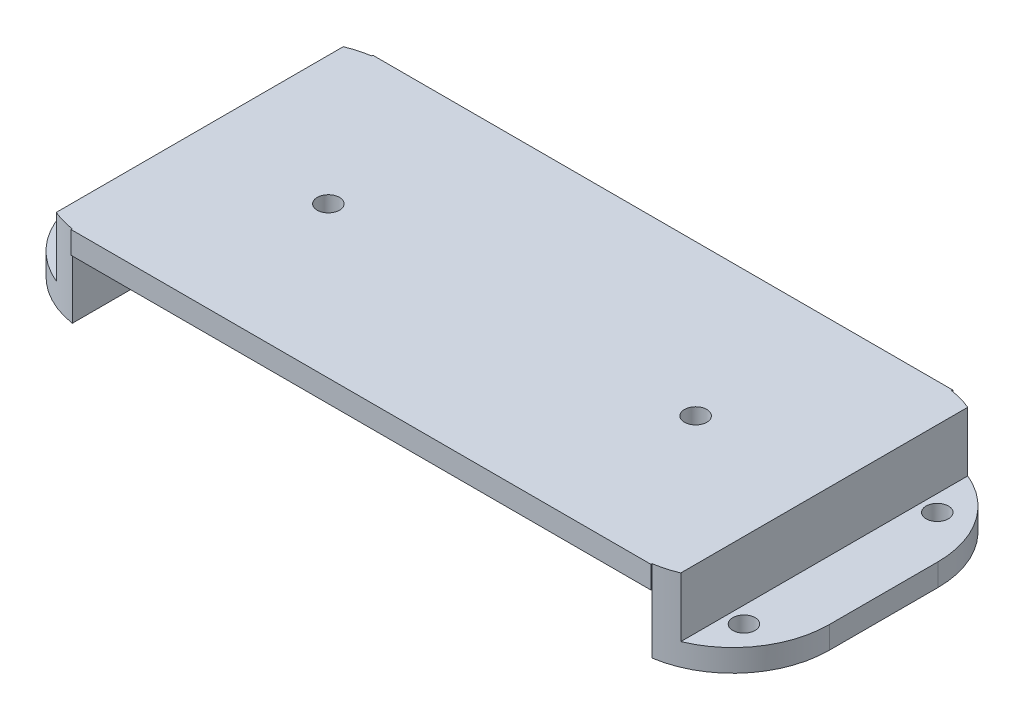
ISO-10303-21;
HEADER;
FILE_DESCRIPTION(('STEP AP214'),'2;1');
FILE_NAME('part.step','',(''),(''),'','','');
FILE_SCHEMA(('AUTOMOTIVE_DESIGN { 1 0 10303 214 1 1 1 1 }'));
ENDSEC;
DATA;
#1=APPLICATION_CONTEXT('core data for automotive mechanical design processes');
#2=APPLICATION_PROTOCOL_DEFINITION('international standard','automotive_design',2000,#1);
#3=PRODUCT_CONTEXT('',#1,'mechanical');
#4=PRODUCT('Part','Part','',(#3));
#5=PRODUCT_RELATED_PRODUCT_CATEGORY('part','',(#4));
#6=PRODUCT_DEFINITION_FORMATION('','',#4);
#7=PRODUCT_DEFINITION_CONTEXT('part definition',#1,'design');
#8=PRODUCT_DEFINITION('design','',#6,#7);
#9=PRODUCT_DEFINITION_SHAPE('','',#8);
#10=(LENGTH_UNIT() NAMED_UNIT(*) SI_UNIT(.MILLI.,.METRE.));
#11=(NAMED_UNIT(*) PLANE_ANGLE_UNIT() SI_UNIT($,.RADIAN.));
#12=(NAMED_UNIT(*) SI_UNIT($,.STERADIAN.) SOLID_ANGLE_UNIT());
#13=UNCERTAINTY_MEASURE_WITH_UNIT(LENGTH_MEASURE(1.E-05),#10,'distance_accuracy_value','');
#14=(GEOMETRIC_REPRESENTATION_CONTEXT(3) GLOBAL_UNCERTAINTY_ASSIGNED_CONTEXT((#13)) GLOBAL_UNIT_ASSIGNED_CONTEXT((#10,
#11,#12)) REPRESENTATION_CONTEXT('',''));
#15=CARTESIAN_POINT('',(0.,0.,0.));
#16=DIRECTION('',(0.,0.,1.));
#17=DIRECTION('',(1.,0.,0.));
#18=AXIS2_PLACEMENT_3D('',#15,#16,#17);
#19=CARTESIAN_POINT('',(0.,-3.6,40.6));
#20=DIRECTION('',(0.,1.,0.));
#21=DIRECTION('',(0.,0.,1.));
#22=AXIS2_PLACEMENT_3D('',#19,#20,#21);
#23=PLANE('',#22);
#24=CARTESIAN_POINT('',(74.8251969934209,-3.6,20.3));
#25=DIRECTION('',(0.,1.,0.));
#26=DIRECTION('',(0.,0.,1.));
#27=AXIS2_PLACEMENT_3D('',#24,#25,#26);
#28=CIRCLE('',#27,1.50000000000001);
#29=CARTESIAN_POINT('',(74.8251969934209,-3.6,21.8));
#30=VERTEX_POINT('',#29);
#31=EDGE_CURVE('E415',#30,#30,#28,.F.);
#32=ORIENTED_EDGE('',*,*,#31,.T.);
#33=EDGE_LOOP('',(#32));
#34=FACE_BOUND('',#33,.T.);
#35=DIRECTION('',(0.,0.,-1.));
#36=VECTOR('',#35,1.);
#37=CARTESIAN_POINT('',(11.1251969934209,-3.6,40.6));
#38=LINE('',#37,#36);
#39=CARTESIAN_POINT('',(11.1251969934209,-3.6,40.6));
#40=VERTEX_POINT('',#39);
#41=CARTESIAN_POINT('',(11.1251969934209,-3.6,40.4452325786651));
#42=VERTEX_POINT('',#41);
#43=EDGE_CURVE('E497',#40,#42,#38,.T.);
#44=ORIENTED_EDGE('',*,*,#43,.F.);
#45=DIRECTION('',(1.,0.,0.));
#46=VECTOR('',#45,1.);
#47=CARTESIAN_POINT('',(0.,-3.6,40.6));
#48=LINE('',#47,#46);
#49=CARTESIAN_POINT('',(89.1251969934209,-3.6,40.6));
#50=VERTEX_POINT('',#49);
#51=EDGE_CURVE('E328',#40,#50,#48,.T.);
#52=ORIENTED_EDGE('',*,*,#51,.T.);
#53=DIRECTION('',(0.,0.,1.));
#54=VECTOR('',#53,1.);
#55=CARTESIAN_POINT('',(89.1251969934209,-3.6,40.6));
#56=LINE('',#55,#54);
#57=CARTESIAN_POINT('',(89.1251969934209,-3.6,40.4452325786651));
#58=VERTEX_POINT('',#57);
#59=EDGE_CURVE('E388',#58,#50,#56,.T.);
#60=ORIENTED_EDGE('',*,*,#59,.F.);
#61=CARTESIAN_POINT('',(87.1251969934209,-3.6,27.6));
#62=DIRECTION('',(0.,1.,0.));
#63=DIRECTION('',(0.,0.,1.));
#64=AXIS2_PLACEMENT_3D('',#61,#62,#63);
#65=CIRCLE('',#64,13.);
#66=CARTESIAN_POINT('',(92.1251969934209,-3.6,39.6));
#67=VERTEX_POINT('',#66);
#68=EDGE_CURVE('E478',#58,#67,#65,.T.);
#69=ORIENTED_EDGE('',*,*,#68,.T.);
#70=DIRECTION('',(0.,0.,-1.));
#71=VECTOR('',#70,1.);
#72=CARTESIAN_POINT('',(92.1251969934209,-3.6,40.6));
#73=LINE('',#72,#71);
#74=CARTESIAN_POINT('',(92.1251969934209,-3.6,0.999999999999996));
#75=VERTEX_POINT('',#74);
#76=EDGE_CURVE('E339',#67,#75,#73,.T.);
#77=ORIENTED_EDGE('',*,*,#76,.T.);
#78=CARTESIAN_POINT('',(87.1251969934209,-3.6,13.));
#79=DIRECTION('',(0.,1.,0.));
#80=DIRECTION('',(0.,0.,1.));
#81=AXIS2_PLACEMENT_3D('',#78,#79,#80);
#82=CIRCLE('',#81,13.);
#83=CARTESIAN_POINT('',(89.1251969934209,-3.6,0.15476742133487));
#84=VERTEX_POINT('',#83);
#85=EDGE_CURVE('E389',#75,#84,#82,.T.);
#86=ORIENTED_EDGE('',*,*,#85,.T.);
#87=DIRECTION('',(0.,0.,1.));
#88=VECTOR('',#87,1.);
#89=CARTESIAN_POINT('',(89.1251969934209,-3.6,40.6));
#90=LINE('',#89,#88);
#91=CARTESIAN_POINT('',(89.1251969934209,-3.6,0.));
#92=VERTEX_POINT('',#91);
#93=EDGE_CURVE('E490',#92,#84,#90,.T.);
#94=ORIENTED_EDGE('',*,*,#93,.F.);
#95=DIRECTION('',(1.,0.,0.));
#96=VECTOR('',#95,1.);
#97=CARTESIAN_POINT('',(0.,-3.6,0.));
#98=LINE('',#97,#96);
#99=CARTESIAN_POINT('',(11.1251969934209,-3.6,0.));
#100=VERTEX_POINT('',#99);
#101=EDGE_CURVE('E524',#100,#92,#98,.T.);
#102=ORIENTED_EDGE('',*,*,#101,.F.);
#103=DIRECTION('',(0.,0.,-1.));
#104=VECTOR('',#103,1.);
#105=CARTESIAN_POINT('',(11.1251969934209,-3.6,40.6));
#106=LINE('',#105,#104);
#107=CARTESIAN_POINT('',(11.1251969934209,-3.6,0.154767421334882));
#108=VERTEX_POINT('',#107);
#109=EDGE_CURVE('E182',#108,#100,#106,.T.);
#110=ORIENTED_EDGE('',*,*,#109,.F.);
#111=CARTESIAN_POINT('',(13.1251969934209,-3.6,13.));
#112=DIRECTION('',(0.,1.,0.));
#113=DIRECTION('',(0.,0.,1.));
#114=AXIS2_PLACEMENT_3D('',#111,#112,#113);
#115=CIRCLE('',#114,13.);
#116=CARTESIAN_POINT('',(8.12519699342092,-3.6,1.));
#117=VERTEX_POINT('',#116);
#118=EDGE_CURVE('E174',#117,#108,#115,.F.);
#119=ORIENTED_EDGE('',*,*,#118,.F.);
#120=DIRECTION('',(0.,0.,-1.));
#121=VECTOR('',#120,1.);
#122=CARTESIAN_POINT('',(8.12519699342092,-3.6,40.6));
#123=LINE('',#122,#121);
#124=CARTESIAN_POINT('',(8.12519699342092,-3.6,39.6));
#125=VERTEX_POINT('',#124);
#126=EDGE_CURVE('E335',#125,#117,#123,.T.);
#127=ORIENTED_EDGE('',*,*,#126,.F.);
#128=CARTESIAN_POINT('',(13.1251969934209,-3.6,27.6));
#129=DIRECTION('',(0.,1.,0.));
#130=DIRECTION('',(0.,0.,1.));
#131=AXIS2_PLACEMENT_3D('',#128,#129,#130);
#132=CIRCLE('',#131,13.);
#133=EDGE_CURVE('E12',#42,#125,#132,.F.);
#134=ORIENTED_EDGE('',*,*,#133,.F.);
#135=EDGE_LOOP('',(#44,#52,#60,#69,#77,#86,#94,#102,#110,#119,#127,#134));
#136=FACE_BOUND('',#135,.T.);
#137=CARTESIAN_POINT('',(25.4251969934209,-3.6,20.3));
#138=DIRECTION('',(0.,1.,0.));
#139=DIRECTION('',(0.,0.,1.));
#140=AXIS2_PLACEMENT_3D('',#137,#138,#139);
#141=CIRCLE('',#140,1.5);
#142=CARTESIAN_POINT('',(25.4251969934209,-3.6,21.8));
#143=VERTEX_POINT('',#142);
#144=EDGE_CURVE('E407',#143,#143,#141,.T.);
#145=ORIENTED_EDGE('',*,*,#144,.F.);
#146=EDGE_LOOP('',(#145));
#147=FACE_BOUND('',#146,.T.);
#148=ADVANCED_FACE('F164',(#34,#136,#147),#23,.T.);
#149=CARTESIAN_POINT('',(0.,-6.6,40.6));
#150=DIRECTION('',(0.,1.,0.));
#151=DIRECTION('',(0.,0.,1.));
#152=AXIS2_PLACEMENT_3D('',#149,#150,#151);
#153=PLANE('',#152);
#154=DIRECTION('',(1.,0.,0.));
#155=VECTOR('',#154,1.);
#156=CARTESIAN_POINT('',(0.,-6.6,0.));
#157=LINE('',#156,#155);
#158=CARTESIAN_POINT('',(11.1251969934209,-6.6,0.));
#159=VERTEX_POINT('',#158);
#160=CARTESIAN_POINT('',(89.1251969934209,-6.6,0.));
#161=VERTEX_POINT('',#160);
#162=EDGE_CURVE('E365',#159,#161,#157,.T.);
#163=ORIENTED_EDGE('',*,*,#162,.T.);
#164=DIRECTION('',(0.,0.,1.));
#165=VECTOR('',#164,1.);
#166=CARTESIAN_POINT('',(89.1251969934209,-6.6,40.6));
#167=LINE('',#166,#165);
#168=CARTESIAN_POINT('',(89.1251969934209,-6.6,0.15476742133487));
#169=VERTEX_POINT('',#168);
#170=EDGE_CURVE('E493',#161,#169,#167,.T.);
#171=ORIENTED_EDGE('',*,*,#170,.T.);
#172=DIRECTION('',(0.,0.,-1.));
#173=VECTOR('',#172,1.);
#174=CARTESIAN_POINT('',(89.1251969934209,-6.6,40.6));
#175=LINE('',#174,#173);
#176=CARTESIAN_POINT('',(89.1251969934209,-6.6,40.4452325786651));
#177=VERTEX_POINT('',#176);
#178=EDGE_CURVE('E347',#177,#169,#175,.T.);
#179=ORIENTED_EDGE('',*,*,#178,.F.);
#180=CARTESIAN_POINT('',(89.1251969934209,-6.6,40.6));
#181=VERTEX_POINT('',#180);
#182=EDGE_CURVE('E348',#181,#177,#175,.T.);
#183=ORIENTED_EDGE('',*,*,#182,.F.);
#184=DIRECTION('',(1.,0.,0.));
#185=VECTOR('',#184,1.);
#186=CARTESIAN_POINT('',(0.,-6.6,40.6));
#187=LINE('',#186,#185);
#188=CARTESIAN_POINT('',(11.1251969934209,-6.6,40.6));
#189=VERTEX_POINT('',#188);
#190=EDGE_CURVE('E520',#189,#181,#187,.T.);
#191=ORIENTED_EDGE('',*,*,#190,.F.);
#192=DIRECTION('',(0.,0.,-1.));
#193=VECTOR('',#192,1.);
#194=CARTESIAN_POINT('',(11.1251969934209,-6.6,40.6));
#195=LINE('',#194,#193);
#196=CARTESIAN_POINT('',(11.1251969934209,-6.6,40.4452325786651));
#197=VERTEX_POINT('',#196);
#198=EDGE_CURVE('E352',#189,#197,#195,.T.);
#199=ORIENTED_EDGE('',*,*,#198,.T.);
#200=CARTESIAN_POINT('',(11.1251969934209,-6.6,0.154767421334882));
#201=VERTEX_POINT('',#200);
#202=EDGE_CURVE('E351',#197,#201,#195,.T.);
#203=ORIENTED_EDGE('',*,*,#202,.T.);
#204=DIRECTION('',(0.,0.,-1.));
#205=VECTOR('',#204,1.);
#206=CARTESIAN_POINT('',(11.1251969934209,-6.6,40.6));
#207=LINE('',#206,#205);
#208=EDGE_CURVE('E502',#201,#159,#207,.T.);
#209=ORIENTED_EDGE('',*,*,#208,.T.);
#210=EDGE_LOOP('',(#163,#171,#179,#183,#191,#199,#203,#209));
#211=FACE_BOUND('',#210,.T.);
#212=CARTESIAN_POINT('',(74.8251969934209,-6.6,20.3));
#213=DIRECTION('',(0.,1.,0.));
#214=DIRECTION('',(0.,0.,1.));
#215=AXIS2_PLACEMENT_3D('',#212,#213,#214);
#216=CIRCLE('',#215,1.50000000000001);
#217=CARTESIAN_POINT('',(74.8251969934209,-6.6,21.8));
#218=VERTEX_POINT('',#217);
#219=EDGE_CURVE('E404',#218,#218,#216,.F.);
#220=ORIENTED_EDGE('',*,*,#219,.F.);
#221=EDGE_LOOP('',(#220));
#222=FACE_BOUND('',#221,.T.);
#223=CARTESIAN_POINT('',(25.4251969934209,-6.6,20.3));
#224=DIRECTION('',(0.,1.,0.));
#225=DIRECTION('',(0.,0.,1.));
#226=AXIS2_PLACEMENT_3D('',#223,#224,#225);
#227=CIRCLE('',#226,1.5);
#228=CARTESIAN_POINT('',(25.4251969934209,-6.6,21.8));
#229=VERTEX_POINT('',#228);
#230=EDGE_CURVE('E168',#229,#229,#227,.T.);
#231=ORIENTED_EDGE('',*,*,#230,.T.);
#232=EDGE_LOOP('',(#231));
#233=FACE_BOUND('',#232,.T.);
#234=ADVANCED_FACE('F557',(#211,#222,#233),#153,.F.);
#235=CARTESIAN_POINT('',(0.,-14.6,40.6));
#236=DIRECTION('',(0.,1.,0.));
#237=DIRECTION('',(0.,0.,1.));
#238=AXIS2_PLACEMENT_3D('',#235,#236,#237);
#239=PLANE('',#238);
#240=CARTESIAN_POINT('',(5.92519699342091,-14.6,7.30000000000001));
#241=DIRECTION('',(0.,-1.,0.));
#242=DIRECTION('',(0.,0.,-1.));
#243=AXIS2_PLACEMENT_3D('',#240,#241,#242);
#244=CIRCLE('',#243,1.5);
#245=CARTESIAN_POINT('',(5.92519699342091,-14.6,5.80000000000002));
#246=VERTEX_POINT('',#245);
#247=EDGE_CURVE('E413',#246,#246,#244,.F.);
#248=ORIENTED_EDGE('',*,*,#247,.T.);
#249=EDGE_LOOP('',(#248));
#250=FACE_BOUND('',#249,.T.);
#251=CARTESIAN_POINT('',(5.92519699342092,-14.6,33.3));
#252=DIRECTION('',(0.,-1.,0.));
#253=DIRECTION('',(0.,0.,-1.));
#254=AXIS2_PLACEMENT_3D('',#251,#252,#253);
#255=CIRCLE('',#254,1.5);
#256=CARTESIAN_POINT('',(5.92519699342092,-14.6,31.8));
#257=VERTEX_POINT('',#256);
#258=EDGE_CURVE('E316',#257,#257,#255,.F.);
#259=ORIENTED_EDGE('',*,*,#258,.T.);
#260=EDGE_LOOP('',(#259));
#261=FACE_BOUND('',#260,.T.);
#262=DIRECTION('',(0.,0.,-1.));
#263=VECTOR('',#262,1.);
#264=CARTESIAN_POINT('',(11.1251969934209,-14.6,40.6));
#265=LINE('',#264,#263);
#266=CARTESIAN_POINT('',(11.1251969934209,-14.6,40.4452325786651));
#267=VERTEX_POINT('',#266);
#268=CARTESIAN_POINT('',(11.1251969934209,-14.6,0.154767421334882));
#269=VERTEX_POINT('',#268);
#270=EDGE_CURVE('E322',#267,#269,#265,.T.);
#271=ORIENTED_EDGE('',*,*,#270,.F.);
#272=CARTESIAN_POINT('',(13.1251969934209,-14.6,27.6));
#273=DIRECTION('',(0.,-1.,0.));
#274=DIRECTION('',(0.,0.,-1.));
#275=AXIS2_PLACEMENT_3D('',#272,#273,#274);
#276=CIRCLE('',#275,13.);
#277=CARTESIAN_POINT('',(0.125196993420919,-14.6,27.5999999999999));
#278=VERTEX_POINT('',#277);
#279=EDGE_CURVE('E320',#278,#267,#276,.F.);
#280=ORIENTED_EDGE('',*,*,#279,.F.);
#281=DIRECTION('',(0.,0.,-1.));
#282=VECTOR('',#281,1.);
#283=CARTESIAN_POINT('',(0.125196993420919,-14.6,40.6));
#284=LINE('',#283,#282);
#285=CARTESIAN_POINT('',(0.125196993420919,-14.6,13.0000000000001));
#286=VERTEX_POINT('',#285);
#287=EDGE_CURVE('E312',#278,#286,#284,.T.);
#288=ORIENTED_EDGE('',*,*,#287,.T.);
#289=CARTESIAN_POINT('',(13.1251969934209,-14.6,13.));
#290=DIRECTION('',(0.,-1.,0.));
#291=DIRECTION('',(0.,0.,-1.));
#292=AXIS2_PLACEMENT_3D('',#289,#290,#291);
#293=CIRCLE('',#292,13.);
#294=EDGE_CURVE('E291',#269,#286,#293,.F.);
#295=ORIENTED_EDGE('',*,*,#294,.F.);
#296=EDGE_LOOP('',(#271,#280,#288,#295));
#297=FACE_BOUND('',#296,.T.);
#298=ADVANCED_FACE('F319',(#250,#261,#297),#239,.F.);
#299=CARTESIAN_POINT('',(0.125196993420918,0.,40.6));
#300=DIRECTION('',(1.,0.,0.));
#301=DIRECTION('',(0.,1.,0.));
#302=AXIS2_PLACEMENT_3D('',#299,#300,#301);
#303=PLANE('',#302);
#304=ORIENTED_EDGE('',*,*,#287,.F.);
#305=DIRECTION('',(0.,-1.,0.));
#306=VECTOR('',#305,1.);
#307=CARTESIAN_POINT('',(0.125196993420919,9.4,27.5999999999999));
#308=LINE('',#307,#306);
#309=CARTESIAN_POINT('',(0.125196993420919,-11.6,27.5999999999999));
#310=VERTEX_POINT('',#309);
#311=EDGE_CURVE('E436',#310,#278,#308,.T.);
#312=ORIENTED_EDGE('',*,*,#311,.F.);
#313=DIRECTION('',(0.,0.,-1.));
#314=VECTOR('',#313,1.);
#315=CARTESIAN_POINT('',(0.125196993420919,-11.6,40.6));
#316=LINE('',#315,#314);
#317=CARTESIAN_POINT('',(0.125196993420919,-11.6,13.0000000000001));
#318=VERTEX_POINT('',#317);
#319=EDGE_CURVE('E314',#310,#318,#316,.T.);
#320=ORIENTED_EDGE('',*,*,#319,.T.);
#321=DIRECTION('',(0.,-1.,0.));
#322=VECTOR('',#321,1.);
#323=CARTESIAN_POINT('',(0.125196993420919,9.4,13.0000000000001));
#324=LINE('',#323,#322);
#325=EDGE_CURVE('E294',#318,#286,#324,.T.);
#326=ORIENTED_EDGE('',*,*,#325,.T.);
#327=EDGE_LOOP('',(#304,#312,#320,#326));
#328=FACE_BOUND('',#327,.T.);
#329=ADVANCED_FACE('F310',(#328),#303,.F.);
#330=CARTESIAN_POINT('',(0.,-11.6,40.6));
#331=DIRECTION('',(0.,-1.,0.));
#332=DIRECTION('',(1.,0.,0.));
#333=AXIS2_PLACEMENT_3D('',#330,#331,#332);
#334=PLANE('',#333);
#335=CARTESIAN_POINT('',(5.92519699342091,-11.6,7.30000000000001));
#336=DIRECTION('',(0.,-1.,0.));
#337=DIRECTION('',(1.,0.,0.));
#338=AXIS2_PLACEMENT_3D('',#335,#336,#337);
#339=CIRCLE('',#338,1.5);
#340=CARTESIAN_POINT('',(7.42519699342091,-11.6,7.30000000000001));
#341=VERTEX_POINT('',#340);
#342=EDGE_CURVE('E370',#341,#341,#339,.F.);
#343=ORIENTED_EDGE('',*,*,#342,.F.);
#344=EDGE_LOOP('',(#343));
#345=FACE_BOUND('',#344,.T.);
#346=CARTESIAN_POINT('',(5.92519699342092,-11.6,33.3));
#347=DIRECTION('',(0.,-1.,0.));
#348=DIRECTION('',(1.,0.,0.));
#349=AXIS2_PLACEMENT_3D('',#346,#347,#348);
#350=CIRCLE('',#349,1.5);
#351=CARTESIAN_POINT('',(7.42519699342092,-11.6,33.3));
#352=VERTEX_POINT('',#351);
#353=EDGE_CURVE('E397',#352,#352,#350,.F.);
#354=ORIENTED_EDGE('',*,*,#353,.F.);
#355=EDGE_LOOP('',(#354));
#356=FACE_BOUND('',#355,.T.);
#357=ORIENTED_EDGE('',*,*,#319,.F.);
#358=CARTESIAN_POINT('',(13.1251969934209,-11.6,27.6));
#359=DIRECTION('',(0.,-1.,0.));
#360=DIRECTION('',(1.,0.,0.));
#361=AXIS2_PLACEMENT_3D('',#358,#359,#360);
#362=CIRCLE('',#361,13.);
#363=CARTESIAN_POINT('',(8.12519699342091,-11.6,39.6));
#364=VERTEX_POINT('',#363);
#365=EDGE_CURVE('E401',#310,#364,#362,.F.);
#366=ORIENTED_EDGE('',*,*,#365,.T.);
#367=DIRECTION('',(0.,0.,-1.));
#368=VECTOR('',#367,1.);
#369=CARTESIAN_POINT('',(8.12519699342092,-11.6,40.6));
#370=LINE('',#369,#368);
#371=CARTESIAN_POINT('',(8.12519699342091,-11.6,1.00000000000001));
#372=VERTEX_POINT('',#371);
#373=EDGE_CURVE('E326',#364,#372,#370,.T.);
#374=ORIENTED_EDGE('',*,*,#373,.T.);
#375=CARTESIAN_POINT('',(13.1251969934209,-11.6,13.));
#376=DIRECTION('',(0.,-1.,0.));
#377=DIRECTION('',(1.,0.,0.));
#378=AXIS2_PLACEMENT_3D('',#375,#376,#377);
#379=CIRCLE('',#378,13.);
#380=EDGE_CURVE('E510',#372,#318,#379,.F.);
#381=ORIENTED_EDGE('',*,*,#380,.T.);
#382=EDGE_LOOP('',(#357,#366,#374,#381));
#383=FACE_BOUND('',#382,.T.);
#384=ADVANCED_FACE('F613',(#345,#356,#383),#334,.F.);
#385=CARTESIAN_POINT('',(89.1251969934209,0.,40.6));
#386=DIRECTION('',(1.,0.,0.));
#387=DIRECTION('',(0.,0.,-1.));
#388=AXIS2_PLACEMENT_3D('',#385,#386,#387);
#389=PLANE('',#388);
#390=DIRECTION('',(0.,-1.,0.));
#391=VECTOR('',#390,1.);
#392=CARTESIAN_POINT('',(89.1251969934209,9.4,0.15476742133487));
#393=LINE('',#392,#391);
#394=CARTESIAN_POINT('',(89.1251969934209,-14.6,0.15476742133487));
#395=VERTEX_POINT('',#394);
#396=EDGE_CURVE('E459',#169,#395,#393,.T.);
#397=ORIENTED_EDGE('',*,*,#396,.T.);
#398=DIRECTION('',(0.,0.,-1.));
#399=VECTOR('',#398,1.);
#400=CARTESIAN_POINT('',(89.1251969934209,-14.6,40.6));
#401=LINE('',#400,#399);
#402=CARTESIAN_POINT('',(89.1251969934209,-14.6,40.4452325786651));
#403=VERTEX_POINT('',#402);
#404=EDGE_CURVE('E343',#403,#395,#401,.T.);
#405=ORIENTED_EDGE('',*,*,#404,.F.);
#406=DIRECTION('',(0.,-1.,0.));
#407=VECTOR('',#406,1.);
#408=CARTESIAN_POINT('',(89.1251969934209,9.4,40.4452325786651));
#409=LINE('',#408,#407);
#410=EDGE_CURVE('E452',#177,#403,#409,.T.);
#411=ORIENTED_EDGE('',*,*,#410,.F.);
#412=ORIENTED_EDGE('',*,*,#178,.T.);
#413=EDGE_LOOP('',(#397,#405,#411,#412));
#414=FACE_BOUND('',#413,.T.);
#415=ADVANCED_FACE('F566',(#414),#389,.F.);
#416=CARTESIAN_POINT('',(92.1251969934209,0.,40.6));
#417=DIRECTION('',(-1.,0.,0.));
#418=DIRECTION('',(0.,0.,1.));
#419=AXIS2_PLACEMENT_3D('',#416,#417,#418);
#420=PLANE('',#419);
#421=DIRECTION('',(0.,-1.,0.));
#422=VECTOR('',#421,1.);
#423=CARTESIAN_POINT('',(92.1251969934209,9.4,0.999999999999996));
#424=LINE('',#423,#422);
#425=CARTESIAN_POINT('',(92.1251969934209,-11.6,0.999999999999996));
#426=VERTEX_POINT('',#425);
#427=EDGE_CURVE('E482',#75,#426,#424,.T.);
#428=ORIENTED_EDGE('',*,*,#427,.F.);
#429=ORIENTED_EDGE('',*,*,#76,.F.);
#430=DIRECTION('',(0.,-1.,0.));
#431=VECTOR('',#430,1.);
#432=CARTESIAN_POINT('',(92.1251969934209,9.4,39.6));
#433=LINE('',#432,#431);
#434=CARTESIAN_POINT('',(92.1251969934209,-11.6,39.6));
#435=VERTEX_POINT('',#434);
#436=EDGE_CURVE('E375',#435,#67,#433,.F.);
#437=ORIENTED_EDGE('',*,*,#436,.F.);
#438=DIRECTION('',(0.,0.,-1.));
#439=VECTOR('',#438,1.);
#440=CARTESIAN_POINT('',(92.1251969934209,-11.6,40.6));
#441=LINE('',#440,#439);
#442=EDGE_CURVE('E356',#435,#426,#441,.T.);
#443=ORIENTED_EDGE('',*,*,#442,.T.);
#444=EDGE_LOOP('',(#428,#429,#437,#443));
#445=FACE_BOUND('',#444,.T.);
#446=ADVANCED_FACE('F580',(#445),#420,.F.);
#447=CARTESIAN_POINT('',(0.,-14.6,40.6));
#448=DIRECTION('',(0.,-1.,0.));
#449=DIRECTION('',(0.,0.,-1.));
#450=AXIS2_PLACEMENT_3D('',#447,#448,#449);
#451=PLANE('',#450);
#452=CARTESIAN_POINT('',(94.3251969934209,-14.6,7.3));
#453=DIRECTION('',(0.,-1.,0.));
#454=DIRECTION('',(0.,0.,-1.));
#455=AXIS2_PLACEMENT_3D('',#452,#453,#454);
#456=CIRCLE('',#455,1.5);
#457=CARTESIAN_POINT('',(94.3251969934209,-14.6,5.8));
#458=VERTEX_POINT('',#457);
#459=EDGE_CURVE('E431',#458,#458,#456,.T.);
#460=ORIENTED_EDGE('',*,*,#459,.F.);
#461=EDGE_LOOP('',(#460));
#462=FACE_BOUND('',#461,.T.);
#463=CARTESIAN_POINT('',(94.3251969934209,-14.6,33.3));
#464=DIRECTION('',(0.,-1.,0.));
#465=DIRECTION('',(0.,0.,-1.));
#466=AXIS2_PLACEMENT_3D('',#463,#464,#465);
#467=CIRCLE('',#466,1.5);
#468=CARTESIAN_POINT('',(94.3251969934209,-14.6,31.8));
#469=VERTEX_POINT('',#468);
#470=EDGE_CURVE('E376',#469,#469,#467,.T.);
#471=ORIENTED_EDGE('',*,*,#470,.F.);
#472=EDGE_LOOP('',(#471));
#473=FACE_BOUND('',#472,.T.);
#474=ORIENTED_EDGE('',*,*,#404,.T.);
#475=CARTESIAN_POINT('',(87.1251969934209,-14.6,13.));
#476=DIRECTION('',(0.,-1.,0.));
#477=DIRECTION('',(0.,0.,-1.));
#478=AXIS2_PLACEMENT_3D('',#475,#476,#477);
#479=CIRCLE('',#478,13.);
#480=CARTESIAN_POINT('',(100.125196993421,-14.6,13.0000000000001));
#481=VERTEX_POINT('',#480);
#482=EDGE_CURVE('E455',#395,#481,#479,.T.);
#483=ORIENTED_EDGE('',*,*,#482,.T.);
#484=DIRECTION('',(0.,0.,-1.));
#485=VECTOR('',#484,1.);
#486=CARTESIAN_POINT('',(100.125196993421,-14.6,40.6));
#487=LINE('',#486,#485);
#488=CARTESIAN_POINT('',(100.125196993421,-14.6,27.5999999999999));
#489=VERTEX_POINT('',#488);
#490=EDGE_CURVE('E361',#489,#481,#487,.T.);
#491=ORIENTED_EDGE('',*,*,#490,.F.);
#492=CARTESIAN_POINT('',(87.1251969934209,-14.6,27.6));
#493=DIRECTION('',(0.,-1.,0.));
#494=DIRECTION('',(0.,0.,-1.));
#495=AXIS2_PLACEMENT_3D('',#492,#493,#494);
#496=CIRCLE('',#495,13.);
#497=EDGE_CURVE('E447',#489,#403,#496,.T.);
#498=ORIENTED_EDGE('',*,*,#497,.T.);
#499=EDGE_LOOP('',(#474,#483,#491,#498));
#500=FACE_BOUND('',#499,.T.);
#501=ADVANCED_FACE('F589',(#462,#473,#500),#451,.T.);
#502=CARTESIAN_POINT('',(100.125196993421,-14.6,40.6));
#503=DIRECTION('',(-1.,0.,0.));
#504=DIRECTION('',(0.,0.,1.));
#505=AXIS2_PLACEMENT_3D('',#502,#503,#504);
#506=PLANE('',#505);
#507=DIRECTION('',(0.,-1.,0.));
#508=VECTOR('',#507,1.);
#509=CARTESIAN_POINT('',(100.125196993421,9.4,13.0000000000001));
#510=LINE('',#509,#508);
#511=CARTESIAN_POINT('',(100.125196993421,-11.6,13.0000000000001));
#512=VERTEX_POINT('',#511);
#513=EDGE_CURVE('E435',#512,#481,#510,.T.);
#514=ORIENTED_EDGE('',*,*,#513,.F.);
#515=DIRECTION('',(0.,0.,-1.));
#516=VECTOR('',#515,1.);
#517=CARTESIAN_POINT('',(100.125196993421,-11.6,40.6));
#518=LINE('',#517,#516);
#519=CARTESIAN_POINT('',(100.125196993421,-11.6,27.5999999999999));
#520=VERTEX_POINT('',#519);
#521=EDGE_CURVE('E366',#520,#512,#518,.T.);
#522=ORIENTED_EDGE('',*,*,#521,.F.);
#523=DIRECTION('',(0.,-1.,0.));
#524=VECTOR('',#523,1.);
#525=CARTESIAN_POINT('',(100.125196993421,9.4,27.5999999999999));
#526=LINE('',#525,#524);
#527=EDGE_CURVE('E190',#520,#489,#526,.T.);
#528=ORIENTED_EDGE('',*,*,#527,.T.);
#529=ORIENTED_EDGE('',*,*,#490,.T.);
#530=EDGE_LOOP('',(#514,#522,#528,#529));
#531=FACE_BOUND('',#530,.T.);
#532=ADVANCED_FACE('F586',(#531),#506,.F.);
#533=CARTESIAN_POINT('',(92.1251969934209,-11.6,40.6));
#534=DIRECTION('',(0.,1.,0.));
#535=DIRECTION('',(0.,0.,1.));
#536=AXIS2_PLACEMENT_3D('',#533,#534,#535);
#537=PLANE('',#536);
#538=CARTESIAN_POINT('',(94.3251969934209,-11.6,7.3));
#539=DIRECTION('',(0.,1.,0.));
#540=DIRECTION('',(0.,0.,1.));
#541=AXIS2_PLACEMENT_3D('',#538,#539,#540);
#542=CIRCLE('',#541,1.5);
#543=CARTESIAN_POINT('',(94.3251969934209,-11.6,8.8));
#544=VERTEX_POINT('',#543);
#545=EDGE_CURVE('E384',#544,#544,#542,.T.);
#546=ORIENTED_EDGE('',*,*,#545,.F.);
#547=EDGE_LOOP('',(#546));
#548=FACE_BOUND('',#547,.T.);
#549=CARTESIAN_POINT('',(94.3251969934209,-11.6,33.3));
#550=DIRECTION('',(0.,1.,0.));
#551=DIRECTION('',(0.,0.,1.));
#552=AXIS2_PLACEMENT_3D('',#549,#550,#551);
#553=CIRCLE('',#552,1.5);
#554=CARTESIAN_POINT('',(94.3251969934209,-11.6,34.8));
#555=VERTEX_POINT('',#554);
#556=EDGE_CURVE('E371',#555,#555,#553,.T.);
#557=ORIENTED_EDGE('',*,*,#556,.F.);
#558=EDGE_LOOP('',(#557));
#559=FACE_BOUND('',#558,.T.);
#560=ORIENTED_EDGE('',*,*,#521,.T.);
#561=CARTESIAN_POINT('',(87.1251969934209,-11.6,13.));
#562=DIRECTION('',(0.,1.,0.));
#563=DIRECTION('',(0.,0.,1.));
#564=AXIS2_PLACEMENT_3D('',#561,#562,#563);
#565=CIRCLE('',#564,13.);
#566=EDGE_CURVE('E379',#512,#426,#565,.T.);
#567=ORIENTED_EDGE('',*,*,#566,.T.);
#568=ORIENTED_EDGE('',*,*,#442,.F.);
#569=CARTESIAN_POINT('',(87.1251969934209,-11.6,27.6));
#570=DIRECTION('',(0.,1.,0.));
#571=DIRECTION('',(0.,0.,1.));
#572=AXIS2_PLACEMENT_3D('',#569,#570,#571);
#573=CIRCLE('',#572,13.);
#574=EDGE_CURVE('E360',#435,#520,#573,.T.);
#575=ORIENTED_EDGE('',*,*,#574,.T.);
#576=EDGE_LOOP('',(#560,#567,#568,#575));
#577=FACE_BOUND('',#576,.T.);
#578=ADVANCED_FACE('F166',(#548,#559,#577),#537,.T.);
#579=CARTESIAN_POINT('',(8.12519699342092,0.,40.6));
#580=DIRECTION('',(1.,0.,0.));
#581=DIRECTION('',(0.,1.,0.));
#582=AXIS2_PLACEMENT_3D('',#579,#580,#581);
#583=PLANE('',#582);
#584=ORIENTED_EDGE('',*,*,#373,.F.);
#585=DIRECTION('',(0.,-1.,0.));
#586=VECTOR('',#585,1.);
#587=CARTESIAN_POINT('',(8.12519699342091,9.4,39.6));
#588=LINE('',#587,#586);
#589=EDGE_CURVE('E513',#364,#125,#588,.F.);
#590=ORIENTED_EDGE('',*,*,#589,.T.);
#591=ORIENTED_EDGE('',*,*,#126,.T.);
#592=DIRECTION('',(0.,-1.,0.));
#593=VECTOR('',#592,1.);
#594=CARTESIAN_POINT('',(8.12519699342091,9.4,1.00000000000001));
#595=LINE('',#594,#593);
#596=EDGE_CURVE('E506',#117,#372,#595,.T.);
#597=ORIENTED_EDGE('',*,*,#596,.T.);
#598=EDGE_LOOP('',(#584,#590,#591,#597));
#599=FACE_BOUND('',#598,.T.);
#600=ADVANCED_FACE('F609',(#599),#583,.F.);
#601=CARTESIAN_POINT('',(11.1251969934209,0.,40.6));
#602=DIRECTION('',(1.,0.,0.));
#603=DIRECTION('',(0.,1.,0.));
#604=AXIS2_PLACEMENT_3D('',#601,#602,#603);
#605=PLANE('',#604);
#606=DIRECTION('',(0.,-1.,0.));
#607=VECTOR('',#606,1.);
#608=CARTESIAN_POINT('',(11.1251969934209,9.4,40.4452325786651));
#609=LINE('',#608,#607);
#610=EDGE_CURVE('E304',#197,#267,#609,.T.);
#611=ORIENTED_EDGE('',*,*,#610,.T.);
#612=ORIENTED_EDGE('',*,*,#270,.T.);
#613=DIRECTION('',(0.,-1.,0.));
#614=VECTOR('',#613,1.);
#615=CARTESIAN_POINT('',(11.1251969934209,9.4,0.154767421334882));
#616=LINE('',#615,#614);
#617=EDGE_CURVE('E298',#201,#269,#616,.T.);
#618=ORIENTED_EDGE('',*,*,#617,.F.);
#619=ORIENTED_EDGE('',*,*,#202,.F.);
#620=EDGE_LOOP('',(#611,#612,#618,#619));
#621=FACE_BOUND('',#620,.T.);
#622=ADVANCED_FACE('F555',(#621),#605,.T.);
#623=CARTESIAN_POINT('',(0.,0.,0.));
#624=DIRECTION('',(0.,0.,1.));
#625=DIRECTION('',(1.,0.,0.));
#626=AXIS2_PLACEMENT_3D('',#623,#624,#625);
#627=PLANE('',#626);
#628=ORIENTED_EDGE('',*,*,#101,.T.);
#629=DIRECTION('',(0.,-1.,0.));
#630=VECTOR('',#629,1.);
#631=CARTESIAN_POINT('',(89.1251969934209,9.4,0.));
#632=LINE('',#631,#630);
#633=EDGE_CURVE('E464',#92,#161,#632,.T.);
#634=ORIENTED_EDGE('',*,*,#633,.T.);
#635=ORIENTED_EDGE('',*,*,#162,.F.);
#636=DIRECTION('',(0.,1.,0.));
#637=VECTOR('',#636,1.);
#638=CARTESIAN_POINT('',(11.1251969934209,0.,0.));
#639=LINE('',#638,#637);
#640=EDGE_CURVE('E392',#159,#100,#639,.T.);
#641=ORIENTED_EDGE('',*,*,#640,.T.);
#642=EDGE_LOOP('',(#628,#634,#635,#641));
#643=FACE_BOUND('',#642,.T.);
#644=ADVANCED_FACE('F534',(#643),#627,.F.);
#645=CARTESIAN_POINT('',(0.,0.,40.6));
#646=DIRECTION('',(0.,0.,1.));
#647=DIRECTION('',(1.,0.,0.));
#648=AXIS2_PLACEMENT_3D('',#645,#646,#647);
#649=PLANE('',#648);
#650=DIRECTION('',(0.,1.,0.));
#651=VECTOR('',#650,1.);
#652=CARTESIAN_POINT('',(11.1251969934209,0.,40.6));
#653=LINE('',#652,#651);
#654=EDGE_CURVE('E383',#189,#40,#653,.T.);
#655=ORIENTED_EDGE('',*,*,#654,.F.);
#656=ORIENTED_EDGE('',*,*,#190,.T.);
#657=DIRECTION('',(0.,-1.,0.));
#658=VECTOR('',#657,1.);
#659=CARTESIAN_POINT('',(89.1251969934209,9.4,40.6));
#660=LINE('',#659,#658);
#661=EDGE_CURVE('E448',#50,#181,#660,.T.);
#662=ORIENTED_EDGE('',*,*,#661,.F.);
#663=ORIENTED_EDGE('',*,*,#51,.F.);
#664=EDGE_LOOP('',(#655,#656,#662,#663));
#665=FACE_BOUND('',#664,.T.);
#666=ADVANCED_FACE('F624',(#665),#649,.T.);
#667=CARTESIAN_POINT('',(94.3251969934209,9.4,33.3));
#668=DIRECTION('',(0.,-1.,0.));
#669=DIRECTION('',(0.,0.,-1.));
#670=AXIS2_PLACEMENT_3D('',#667,#668,#669);
#671=CYLINDRICAL_SURFACE('',#670,1.5);
#672=ORIENTED_EDGE('',*,*,#556,.T.);
#673=EDGE_LOOP('',(#672));
#674=FACE_BOUND('',#673,.T.);
#675=ORIENTED_EDGE('',*,*,#470,.T.);
#676=EDGE_LOOP('',(#675));
#677=FACE_BOUND('',#676,.T.);
#678=ADVANCED_FACE('F627',(#674,#677),#671,.F.);
#679=CARTESIAN_POINT('',(89.1251969934209,9.4,0.));
#680=DIRECTION('',(-1.,0.,0.));
#681=DIRECTION('',(0.,0.,1.));
#682=AXIS2_PLACEMENT_3D('',#679,#680,#681);
#683=PLANE('',#682);
#684=EDGE_CURVE('E451',#58,#177,#409,.T.);
#685=ORIENTED_EDGE('',*,*,#684,.F.);
#686=ORIENTED_EDGE('',*,*,#59,.T.);
#687=ORIENTED_EDGE('',*,*,#661,.T.);
#688=ORIENTED_EDGE('',*,*,#182,.T.);
#689=EDGE_LOOP('',(#685,#686,#687,#688));
#690=FACE_BOUND('',#689,.T.);
#691=ADVANCED_FACE('F572',(#690),#683,.F.);
#692=CARTESIAN_POINT('',(87.1251969934209,9.4,27.6));
#693=DIRECTION('',(0.,-1.,0.));
#694=DIRECTION('',(0.,0.,-1.));
#695=AXIS2_PLACEMENT_3D('',#692,#693,#694);
#696=CYLINDRICAL_SURFACE('',#695,13.);
#697=ORIENTED_EDGE('',*,*,#684,.T.);
#698=ORIENTED_EDGE('',*,*,#410,.T.);
#699=ORIENTED_EDGE('',*,*,#497,.F.);
#700=ORIENTED_EDGE('',*,*,#527,.F.);
#701=ORIENTED_EDGE('',*,*,#574,.F.);
#702=ORIENTED_EDGE('',*,*,#436,.T.);
#703=ORIENTED_EDGE('',*,*,#68,.F.);
#704=EDGE_LOOP('',(#697,#698,#699,#700,#701,#702,#703));
#705=FACE_BOUND('',#704,.T.);
#706=ADVANCED_FACE('F575',(#705),#696,.T.);
#707=CARTESIAN_POINT('',(89.1251969934209,9.4,0.));
#708=DIRECTION('',(-1.,0.,0.));
#709=DIRECTION('',(0.,0.,1.));
#710=AXIS2_PLACEMENT_3D('',#707,#708,#709);
#711=PLANE('',#710);
#712=ORIENTED_EDGE('',*,*,#633,.F.);
#713=ORIENTED_EDGE('',*,*,#93,.T.);
#714=EDGE_CURVE('E463',#84,#169,#393,.T.);
#715=ORIENTED_EDGE('',*,*,#714,.T.);
#716=ORIENTED_EDGE('',*,*,#170,.F.);
#717=EDGE_LOOP('',(#712,#713,#715,#716));
#718=FACE_BOUND('',#717,.T.);
#719=ADVANCED_FACE('F544',(#718),#711,.F.);
#720=CARTESIAN_POINT('',(87.1251969934209,9.4,13.));
#721=DIRECTION('',(0.,-1.,0.));
#722=DIRECTION('',(0.,0.,-1.));
#723=AXIS2_PLACEMENT_3D('',#720,#721,#722);
#724=CYLINDRICAL_SURFACE('',#723,13.);
#725=ORIENTED_EDGE('',*,*,#427,.T.);
#726=ORIENTED_EDGE('',*,*,#566,.F.);
#727=ORIENTED_EDGE('',*,*,#513,.T.);
#728=ORIENTED_EDGE('',*,*,#482,.F.);
#729=ORIENTED_EDGE('',*,*,#396,.F.);
#730=ORIENTED_EDGE('',*,*,#714,.F.);
#731=ORIENTED_EDGE('',*,*,#85,.F.);
#732=EDGE_LOOP('',(#725,#726,#727,#728,#729,#730,#731));
#733=FACE_BOUND('',#732,.T.);
#734=ADVANCED_FACE('F546',(#733),#724,.T.);
#735=CARTESIAN_POINT('',(94.3251969934209,9.4,7.3));
#736=DIRECTION('',(0.,-1.,0.));
#737=DIRECTION('',(0.,0.,-1.));
#738=AXIS2_PLACEMENT_3D('',#735,#736,#737);
#739=CYLINDRICAL_SURFACE('',#738,1.5);
#740=ORIENTED_EDGE('',*,*,#545,.T.);
#741=EDGE_LOOP('',(#740));
#742=FACE_BOUND('',#741,.T.);
#743=ORIENTED_EDGE('',*,*,#459,.T.);
#744=EDGE_LOOP('',(#743));
#745=FACE_BOUND('',#744,.T.);
#746=ADVANCED_FACE('F636',(#742,#745),#739,.F.);
#747=CARTESIAN_POINT('',(13.1251969934209,9.4,27.6));
#748=DIRECTION('',(0.,-1.,0.));
#749=DIRECTION('',(0.,0.,-1.));
#750=AXIS2_PLACEMENT_3D('',#747,#748,#749);
#751=CYLINDRICAL_SURFACE('',#750,13.);
#752=ORIENTED_EDGE('',*,*,#311,.T.);
#753=ORIENTED_EDGE('',*,*,#279,.T.);
#754=ORIENTED_EDGE('',*,*,#610,.F.);
#755=EDGE_CURVE('E439',#42,#197,#609,.T.);
#756=ORIENTED_EDGE('',*,*,#755,.F.);
#757=ORIENTED_EDGE('',*,*,#133,.T.);
#758=ORIENTED_EDGE('',*,*,#589,.F.);
#759=ORIENTED_EDGE('',*,*,#365,.F.);
#760=EDGE_LOOP('',(#752,#753,#754,#756,#757,#758,#759));
#761=FACE_BOUND('',#760,.T.);
#762=ADVANCED_FACE('F644',(#761),#751,.T.);
#763=CARTESIAN_POINT('',(11.1251969934209,9.4,0.));
#764=DIRECTION('',(1.,0.,0.));
#765=DIRECTION('',(0.,0.,-1.));
#766=AXIS2_PLACEMENT_3D('',#763,#764,#765);
#767=PLANE('',#766);
#768=ORIENTED_EDGE('',*,*,#654,.T.);
#769=ORIENTED_EDGE('',*,*,#43,.T.);
#770=ORIENTED_EDGE('',*,*,#755,.T.);
#771=ORIENTED_EDGE('',*,*,#198,.F.);
#772=EDGE_LOOP('',(#768,#769,#770,#771));
#773=FACE_BOUND('',#772,.T.);
#774=ADVANCED_FACE('F641',(#773),#767,.F.);
#775=CARTESIAN_POINT('',(13.1251969934209,9.4,13.));
#776=DIRECTION('',(0.,-1.,0.));
#777=DIRECTION('',(0.,0.,-1.));
#778=AXIS2_PLACEMENT_3D('',#775,#776,#777);
#779=CYLINDRICAL_SURFACE('',#778,13.);
#780=ORIENTED_EDGE('',*,*,#596,.F.);
#781=ORIENTED_EDGE('',*,*,#118,.T.);
#782=EDGE_CURVE('E305',#108,#201,#616,.T.);
#783=ORIENTED_EDGE('',*,*,#782,.T.);
#784=ORIENTED_EDGE('',*,*,#617,.T.);
#785=ORIENTED_EDGE('',*,*,#294,.T.);
#786=ORIENTED_EDGE('',*,*,#325,.F.);
#787=ORIENTED_EDGE('',*,*,#380,.F.);
#788=EDGE_LOOP('',(#780,#781,#783,#784,#785,#786,#787));
#789=FACE_BOUND('',#788,.T.);
#790=ADVANCED_FACE('F293',(#789),#779,.T.);
#791=CARTESIAN_POINT('',(11.1251969934209,9.4,0.));
#792=DIRECTION('',(1.,0.,0.));
#793=DIRECTION('',(0.,0.,-1.));
#794=AXIS2_PLACEMENT_3D('',#791,#792,#793);
#795=PLANE('',#794);
#796=ORIENTED_EDGE('',*,*,#782,.F.);
#797=ORIENTED_EDGE('',*,*,#109,.T.);
#798=ORIENTED_EDGE('',*,*,#640,.F.);
#799=ORIENTED_EDGE('',*,*,#208,.F.);
#800=EDGE_LOOP('',(#796,#797,#798,#799));
#801=FACE_BOUND('',#800,.T.);
#802=ADVANCED_FACE('F656',(#801),#795,.F.);
#803=CARTESIAN_POINT('',(5.92519699342092,9.4,33.3));
#804=DIRECTION('',(0.,-1.,0.));
#805=DIRECTION('',(0.,0.,-1.));
#806=AXIS2_PLACEMENT_3D('',#803,#804,#805);
#807=CYLINDRICAL_SURFACE('',#806,1.5);
#808=ORIENTED_EDGE('',*,*,#258,.F.);
#809=EDGE_LOOP('',(#808));
#810=FACE_BOUND('',#809,.T.);
#811=ORIENTED_EDGE('',*,*,#353,.T.);
#812=EDGE_LOOP('',(#811));
#813=FACE_BOUND('',#812,.T.);
#814=ADVANCED_FACE('F652',(#810,#813),#807,.F.);
#815=CARTESIAN_POINT('',(5.92519699342091,9.4,7.30000000000001));
#816=DIRECTION('',(0.,-1.,0.));
#817=DIRECTION('',(0.,0.,-1.));
#818=AXIS2_PLACEMENT_3D('',#815,#816,#817);
#819=CYLINDRICAL_SURFACE('',#818,1.5);
#820=ORIENTED_EDGE('',*,*,#247,.F.);
#821=EDGE_LOOP('',(#820));
#822=FACE_BOUND('',#821,.T.);
#823=ORIENTED_EDGE('',*,*,#342,.T.);
#824=EDGE_LOOP('',(#823));
#825=FACE_BOUND('',#824,.T.);
#826=ADVANCED_FACE('F655',(#822,#825),#819,.F.);
#827=CARTESIAN_POINT('',(74.8251969934209,-7.6,20.3));
#828=DIRECTION('',(0.,1.,0.));
#829=DIRECTION('',(0.,0.,1.));
#830=AXIS2_PLACEMENT_3D('',#827,#828,#829);
#831=CYLINDRICAL_SURFACE('',#830,1.50000000000001);
#832=ORIENTED_EDGE('',*,*,#31,.F.);
#833=EDGE_LOOP('',(#832));
#834=FACE_BOUND('',#833,.T.);
#835=ORIENTED_EDGE('',*,*,#219,.T.);
#836=EDGE_LOOP('',(#835));
#837=FACE_BOUND('',#836,.T.);
#838=ADVANCED_FACE('F664',(#834,#837),#831,.F.);
#839=CARTESIAN_POINT('',(25.4251969934209,-7.6,20.3));
#840=DIRECTION('',(0.,1.,0.));
#841=DIRECTION('',(0.,0.,1.));
#842=AXIS2_PLACEMENT_3D('',#839,#840,#841);
#843=CYLINDRICAL_SURFACE('',#842,1.5);
#844=ORIENTED_EDGE('',*,*,#144,.T.);
#845=EDGE_LOOP('',(#844));
#846=FACE_BOUND('',#845,.T.);
#847=ORIENTED_EDGE('',*,*,#230,.F.);
#848=EDGE_LOOP('',(#847));
#849=FACE_BOUND('',#848,.T.);
#850=ADVANCED_FACE('F668',(#846,#849),#843,.F.);
#851=CLOSED_SHELL('',(#148,#234,#298,#329,#384,#415,#446,#501,#532,#578,#600,#622,#644,#666,
#678,#691,#706,#719,#734,#746,#762,#774,#790,#802,#814,#826,#838,#850));
#852=MANIFOLD_SOLID_BREP('B2',#851);
#853=ADVANCED_BREP_SHAPE_REPRESENTATION('',(#18,#852),#14);
#854=SHAPE_DEFINITION_REPRESENTATION(#9,#853);
ENDSEC;
END-ISO-10303-21;
